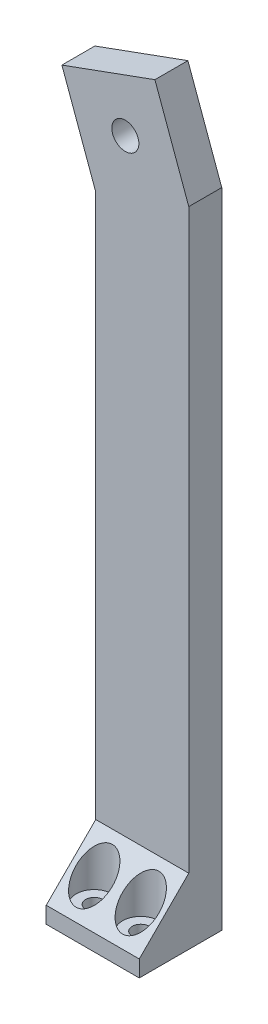
ISO-10303-21;
HEADER;
FILE_DESCRIPTION(('STEP AP214'),'2;1');
FILE_NAME('part.step','',(''),(''),'','','');
FILE_SCHEMA(('AUTOMOTIVE_DESIGN { 1 0 10303 214 1 1 1 1 }'));
ENDSEC;
DATA;
#1=APPLICATION_CONTEXT('core data for automotive mechanical design processes');
#2=APPLICATION_PROTOCOL_DEFINITION('international standard','automotive_design',2000,#1);
#3=PRODUCT_CONTEXT('',#1,'mechanical');
#4=PRODUCT('Part','Part','',(#3));
#5=PRODUCT_RELATED_PRODUCT_CATEGORY('part','',(#4));
#6=PRODUCT_DEFINITION_FORMATION('','',#4);
#7=PRODUCT_DEFINITION_CONTEXT('part definition',#1,'design');
#8=PRODUCT_DEFINITION('design','',#6,#7);
#9=PRODUCT_DEFINITION_SHAPE('','',#8);
#10=(LENGTH_UNIT() NAMED_UNIT(*) SI_UNIT(.MILLI.,.METRE.));
#11=(NAMED_UNIT(*) PLANE_ANGLE_UNIT() SI_UNIT($,.RADIAN.));
#12=(NAMED_UNIT(*) SI_UNIT($,.STERADIAN.) SOLID_ANGLE_UNIT());
#13=UNCERTAINTY_MEASURE_WITH_UNIT(LENGTH_MEASURE(1.E-05),#10,'distance_accuracy_value','');
#14=(GEOMETRIC_REPRESENTATION_CONTEXT(3) GLOBAL_UNCERTAINTY_ASSIGNED_CONTEXT((#13)) GLOBAL_UNIT_ASSIGNED_CONTEXT((#10,
#11,#12)) REPRESENTATION_CONTEXT('',''));
#15=CARTESIAN_POINT('',(0.,0.,0.));
#16=DIRECTION('',(0.,0.,1.));
#17=DIRECTION('',(1.,0.,0.));
#18=AXIS2_PLACEMENT_3D('',#15,#16,#17);
#19=CARTESIAN_POINT('',(514.481709880284,-15.,17.5));
#20=DIRECTION('',(0.,1.,0.));
#21=DIRECTION('',(0.,0.,1.));
#22=AXIS2_PLACEMENT_3D('',#19,#20,#21);
#23=CYLINDRICAL_SURFACE('',#22,2.60000000000007);
#24=CARTESIAN_POINT('',(514.481709880284,0.,17.5));
#25=DIRECTION('',(0.,1.,0.));
#26=DIRECTION('',(0.,0.,1.));
#27=AXIS2_PLACEMENT_3D('',#24,#25,#26);
#28=CIRCLE('',#27,2.60000000000007);
#29=CARTESIAN_POINT('',(514.481709880284,0.,20.1000000000001));
#30=VERTEX_POINT('',#29);
#31=EDGE_CURVE('E130',#30,#30,#28,.T.);
#32=ORIENTED_EDGE('',*,*,#31,.F.);
#33=EDGE_LOOP('',(#32));
#34=FACE_BOUND('',#33,.T.);
#35=CARTESIAN_POINT('',(514.481709880284,5.,17.5));
#36=DIRECTION('',(0.,1.,0.));
#37=DIRECTION('',(0.,0.,1.));
#38=AXIS2_PLACEMENT_3D('',#35,#36,#37);
#39=CIRCLE('',#38,2.60000000000007);
#40=CARTESIAN_POINT('',(514.481709880284,5.,20.1000000000001));
#41=VERTEX_POINT('',#40);
#42=EDGE_CURVE('E41',#41,#41,#39,.F.);
#43=ORIENTED_EDGE('',*,*,#42,.F.);
#44=EDGE_LOOP('',(#43));
#45=FACE_BOUND('',#44,.T.);
#46=ADVANCED_FACE('F36',(#34,#45),#23,.F.);
#47=CARTESIAN_POINT('',(528.577099192073,-15.,17.5));
#48=DIRECTION('',(0.,1.,0.));
#49=DIRECTION('',(0.,0.,1.));
#50=AXIS2_PLACEMENT_3D('',#47,#48,#49);
#51=CYLINDRICAL_SURFACE('',#50,2.60000000000007);
#52=CARTESIAN_POINT('',(528.577099192073,0.,17.5));
#53=DIRECTION('',(0.,1.,0.));
#54=DIRECTION('',(0.,0.,1.));
#55=AXIS2_PLACEMENT_3D('',#52,#53,#54);
#56=CIRCLE('',#55,2.60000000000007);
#57=CARTESIAN_POINT('',(528.577099192073,0.,20.1000000000001));
#58=VERTEX_POINT('',#57);
#59=EDGE_CURVE('E127',#58,#58,#56,.T.);
#60=ORIENTED_EDGE('',*,*,#59,.F.);
#61=EDGE_LOOP('',(#60));
#62=FACE_BOUND('',#61,.T.);
#63=CARTESIAN_POINT('',(528.577099192073,5.,17.5));
#64=DIRECTION('',(0.,1.,0.));
#65=DIRECTION('',(0.,0.,1.));
#66=AXIS2_PLACEMENT_3D('',#63,#64,#65);
#67=CIRCLE('',#66,2.60000000000007);
#68=CARTESIAN_POINT('',(528.577099192073,5.,20.1000000000001));
#69=VERTEX_POINT('',#68);
#70=EDGE_CURVE('E184',#69,#69,#67,.F.);
#71=ORIENTED_EDGE('',*,*,#70,.F.);
#72=EDGE_LOOP('',(#71));
#73=FACE_BOUND('',#72,.T.);
#74=ADVANCED_FACE('F252',(#62,#73),#51,.F.);
#75=CARTESIAN_POINT('',(0.,0.,10.));
#76=DIRECTION('',(0.,0.,-1.));
#77=DIRECTION('',(-1.,0.,0.));
#78=AXIS2_PLACEMENT_3D('',#75,#76,#77);
#79=PLANE('',#78);
#80=CARTESIAN_POINT('',(516.399102386291,203.91656885754,10.));
#81=DIRECTION('',(0.,0.,1.));
#82=DIRECTION('',(1.,0.,0.));
#83=AXIS2_PLACEMENT_3D('',#80,#81,#82);
#84=CIRCLE('',#83,4.10000000000036);
#85=CARTESIAN_POINT('',(520.499102386291,203.91656885754,10.));
#86=VERTEX_POINT('',#85);
#87=EDGE_CURVE('E137',#86,#86,#84,.T.);
#88=ORIENTED_EDGE('',*,*,#87,.F.);
#89=EDGE_LOOP('',(#88));
#90=FACE_BOUND('',#89,.T.);
#91=DIRECTION('',(0.,-1.,0.));
#92=VECTOR('',#91,1.);
#93=CARTESIAN_POINT('',(507.434015224388,184.690877395868,10.));
#94=LINE('',#93,#92);
#95=CARTESIAN_POINT('',(507.434015224388,184.690877395868,10.));
#96=VERTEX_POINT('',#95);
#97=CARTESIAN_POINT('',(507.43401522439,19.9999999999999,10.));
#98=VERTEX_POINT('',#97);
#99=EDGE_CURVE('E151',#96,#98,#94,.T.);
#100=ORIENTED_EDGE('',*,*,#99,.T.);
#101=DIRECTION('',(1.,0.,0.));
#102=VECTOR('',#101,1.);
#103=CARTESIAN_POINT('',(535.624793847968,19.9999999999999,10.));
#104=LINE('',#103,#102);
#105=CARTESIAN_POINT('',(535.624793847967,19.9999999999999,10.));
#106=VERTEX_POINT('',#105);
#107=EDGE_CURVE('E60',#98,#106,#104,.T.);
#108=ORIENTED_EDGE('',*,*,#107,.T.);
#109=DIRECTION('',(0.,1.,0.));
#110=VECTOR('',#109,1.);
#111=CARTESIAN_POINT('',(535.624793847965,194.951481695638,10.));
#112=LINE('',#111,#110);
#113=CARTESIAN_POINT('',(535.624793847965,194.951481695638,10.));
#114=VERTEX_POINT('',#113);
#115=EDGE_CURVE('E153',#106,#114,#112,.T.);
#116=ORIENTED_EDGE('',*,*,#115,.T.);
#117=DIRECTION('',(-0.34202014332568,0.939692620785904,0.));
#118=VECTOR('',#117,1.);
#119=CARTESIAN_POINT('',(535.624793847965,194.951481695638,10.));
#120=LINE('',#119,#118);
#121=CARTESIAN_POINT('',(525.364189548195,223.142260319215,10.));
#122=VERTEX_POINT('',#121);
#123=EDGE_CURVE('E143',#114,#122,#120,.T.);
#124=ORIENTED_EDGE('',*,*,#123,.T.);
#125=DIRECTION('',(-0.939692620785904,-0.342020143325681,0.));
#126=VECTOR('',#125,1.);
#127=CARTESIAN_POINT('',(497.173410924618,212.881656019444,10.));
#128=LINE('',#127,#126);
#129=CARTESIAN_POINT('',(497.173410924618,212.881656019444,10.));
#130=VERTEX_POINT('',#129);
#131=EDGE_CURVE('E146',#122,#130,#128,.T.);
#132=ORIENTED_EDGE('',*,*,#131,.T.);
#133=DIRECTION('',(0.34202014332568,-0.939692620785904,0.));
#134=VECTOR('',#133,1.);
#135=CARTESIAN_POINT('',(507.434015224388,184.690877395868,10.));
#136=LINE('',#135,#134);
#137=EDGE_CURVE('E149',#130,#96,#136,.T.);
#138=ORIENTED_EDGE('',*,*,#137,.T.);
#139=EDGE_LOOP('',(#100,#108,#116,#124,#132,#138));
#140=FACE_BOUND('',#139,.T.);
#141=ADVANCED_FACE('F219',(#90,#140),#79,.F.);
#142=CARTESIAN_POINT('',(0.,0.,0.));
#143=DIRECTION('',(0.,0.,-1.));
#144=DIRECTION('',(-1.,0.,0.));
#145=AXIS2_PLACEMENT_3D('',#142,#143,#144);
#146=PLANE('',#145);
#147=DIRECTION('',(-0.34202014332568,0.939692620785904,0.));
#148=VECTOR('',#147,1.);
#149=CARTESIAN_POINT('',(535.624793847965,194.951481695638,0.));
#150=LINE('',#149,#148);
#151=CARTESIAN_POINT('',(535.624793847965,194.951481695638,0.));
#152=VERTEX_POINT('',#151);
#153=CARTESIAN_POINT('',(525.364189548195,223.142260319215,0.));
#154=VERTEX_POINT('',#153);
#155=EDGE_CURVE('E140',#152,#154,#150,.T.);
#156=ORIENTED_EDGE('',*,*,#155,.F.);
#157=DIRECTION('',(0.,1.,0.));
#158=VECTOR('',#157,1.);
#159=CARTESIAN_POINT('',(535.624793847965,194.951481695638,0.));
#160=LINE('',#159,#158);
#161=CARTESIAN_POINT('',(535.624793847968,0.,0.));
#162=VERTEX_POINT('',#161);
#163=EDGE_CURVE('E147',#162,#152,#160,.T.);
#164=ORIENTED_EDGE('',*,*,#163,.F.);
#165=DIRECTION('',(1.,0.,0.));
#166=VECTOR('',#165,1.);
#167=CARTESIAN_POINT('',(507.43401522439,0.,0.));
#168=LINE('',#167,#166);
#169=CARTESIAN_POINT('',(507.43401522439,0.,0.));
#170=VERTEX_POINT('',#169);
#171=EDGE_CURVE('E163',#170,#162,#168,.T.);
#172=ORIENTED_EDGE('',*,*,#171,.F.);
#173=DIRECTION('',(0.,-1.,0.));
#174=VECTOR('',#173,1.);
#175=CARTESIAN_POINT('',(507.434015224388,184.690877395868,0.));
#176=LINE('',#175,#174);
#177=CARTESIAN_POINT('',(507.434015224388,184.690877395868,0.));
#178=VERTEX_POINT('',#177);
#179=EDGE_CURVE('E108',#178,#170,#176,.T.);
#180=ORIENTED_EDGE('',*,*,#179,.F.);
#181=DIRECTION('',(0.34202014332568,-0.939692620785904,0.));
#182=VECTOR('',#181,1.);
#183=CARTESIAN_POINT('',(507.434015224388,184.690877395868,0.));
#184=LINE('',#183,#182);
#185=CARTESIAN_POINT('',(497.173410924618,212.881656019444,0.));
#186=VERTEX_POINT('',#185);
#187=EDGE_CURVE('E160',#186,#178,#184,.T.);
#188=ORIENTED_EDGE('',*,*,#187,.F.);
#189=DIRECTION('',(-0.939692620785904,-0.342020143325681,0.));
#190=VECTOR('',#189,1.);
#191=CARTESIAN_POINT('',(497.173410924618,212.881656019444,0.));
#192=LINE('',#191,#190);
#193=EDGE_CURVE('E158',#154,#186,#192,.T.);
#194=ORIENTED_EDGE('',*,*,#193,.F.);
#195=EDGE_LOOP('',(#156,#164,#172,#180,#188,#194));
#196=FACE_BOUND('',#195,.T.);
#197=CARTESIAN_POINT('',(516.399102386291,203.91656885754,0.));
#198=DIRECTION('',(0.,0.,1.));
#199=DIRECTION('',(1.,0.,0.));
#200=AXIS2_PLACEMENT_3D('',#197,#198,#199);
#201=CIRCLE('',#200,4.10000000000036);
#202=CARTESIAN_POINT('',(520.499102386291,203.91656885754,0.));
#203=VERTEX_POINT('',#202);
#204=EDGE_CURVE('E136',#203,#203,#201,.T.);
#205=ORIENTED_EDGE('',*,*,#204,.T.);
#206=EDGE_LOOP('',(#205));
#207=FACE_BOUND('',#206,.T.);
#208=ADVANCED_FACE('F233',(#196,#207),#146,.T.);
#209=CARTESIAN_POINT('',(535.624793847965,194.951481695638,10.));
#210=DIRECTION('',(-0.939692620785904,-0.34202014332568,0.));
#211=DIRECTION('',(0.34202014332568,-0.939692620785904,0.));
#212=AXIS2_PLACEMENT_3D('',#209,#210,#211);
#213=PLANE('',#212);
#214=ORIENTED_EDGE('',*,*,#155,.T.);
#215=DIRECTION('',(0.,0.,-1.));
#216=VECTOR('',#215,1.);
#217=CARTESIAN_POINT('',(525.364189548195,223.142260319215,10.));
#218=LINE('',#217,#216);
#219=EDGE_CURVE('E173',#122,#154,#218,.T.);
#220=ORIENTED_EDGE('',*,*,#219,.F.);
#221=ORIENTED_EDGE('',*,*,#123,.F.);
#222=DIRECTION('',(0.,0.,-1.));
#223=VECTOR('',#222,1.);
#224=CARTESIAN_POINT('',(535.624793847965,194.951481695638,10.));
#225=LINE('',#224,#223);
#226=EDGE_CURVE('E155',#114,#152,#225,.T.);
#227=ORIENTED_EDGE('',*,*,#226,.T.);
#228=EDGE_LOOP('',(#214,#220,#221,#227));
#229=FACE_BOUND('',#228,.T.);
#230=ADVANCED_FACE('F223',(#229),#213,.F.);
#231=CARTESIAN_POINT('',(497.173410924618,212.881656019444,10.));
#232=DIRECTION('',(0.342020143325681,-0.939692620785904,0.));
#233=DIRECTION('',(0.939692620785904,0.342020143325681,0.));
#234=AXIS2_PLACEMENT_3D('',#231,#232,#233);
#235=PLANE('',#234);
#236=ORIENTED_EDGE('',*,*,#193,.T.);
#237=DIRECTION('',(0.,0.,-1.));
#238=VECTOR('',#237,1.);
#239=CARTESIAN_POINT('',(497.173410924618,212.881656019444,10.));
#240=LINE('',#239,#238);
#241=EDGE_CURVE('E170',#130,#186,#240,.T.);
#242=ORIENTED_EDGE('',*,*,#241,.F.);
#243=ORIENTED_EDGE('',*,*,#131,.F.);
#244=ORIENTED_EDGE('',*,*,#219,.T.);
#245=EDGE_LOOP('',(#236,#242,#243,#244));
#246=FACE_BOUND('',#245,.T.);
#247=ADVANCED_FACE('F226',(#246),#235,.F.);
#248=CARTESIAN_POINT('',(507.434015224388,184.690877395868,10.));
#249=DIRECTION('',(0.939692620785904,0.34202014332568,0.));
#250=DIRECTION('',(-0.34202014332568,0.939692620785904,0.));
#251=AXIS2_PLACEMENT_3D('',#248,#249,#250);
#252=PLANE('',#251);
#253=ORIENTED_EDGE('',*,*,#187,.T.);
#254=DIRECTION('',(0.,0.,-1.));
#255=VECTOR('',#254,1.);
#256=CARTESIAN_POINT('',(507.434015224388,184.690877395868,10.));
#257=LINE('',#256,#255);
#258=EDGE_CURVE('E111',#96,#178,#257,.T.);
#259=ORIENTED_EDGE('',*,*,#258,.F.);
#260=ORIENTED_EDGE('',*,*,#137,.F.);
#261=ORIENTED_EDGE('',*,*,#241,.T.);
#262=EDGE_LOOP('',(#253,#259,#260,#261));
#263=FACE_BOUND('',#262,.T.);
#264=ADVANCED_FACE('F231',(#263),#252,.F.);
#265=CARTESIAN_POINT('',(507.434015224388,184.690877395868,10.));
#266=DIRECTION('',(1.,0.,0.));
#267=DIRECTION('',(0.,1.,0.));
#268=AXIS2_PLACEMENT_3D('',#265,#266,#267);
#269=PLANE('',#268);
#270=ORIENTED_EDGE('',*,*,#179,.T.);
#271=DIRECTION('',(0.,0.,-1.));
#272=VECTOR('',#271,1.);
#273=CARTESIAN_POINT('',(507.43401522439,0.,10.));
#274=LINE('',#273,#272);
#275=CARTESIAN_POINT('',(507.43401522439,0.,25.));
#276=VERTEX_POINT('',#275);
#277=EDGE_CURVE('E101',#276,#170,#274,.T.);
#278=ORIENTED_EDGE('',*,*,#277,.F.);
#279=DIRECTION('',(0.,-1.,0.));
#280=VECTOR('',#279,1.);
#281=CARTESIAN_POINT('',(507.43401522439,0.,25.));
#282=LINE('',#281,#280);
#283=CARTESIAN_POINT('',(507.43401522439,5.,25.));
#284=VERTEX_POINT('',#283);
#285=EDGE_CURVE('E105',#284,#276,#282,.T.);
#286=ORIENTED_EDGE('',*,*,#285,.F.);
#287=DIRECTION('',(0.,-0.707106781186546,0.707106781186549));
#288=VECTOR('',#287,1.);
#289=CARTESIAN_POINT('',(507.434015224389,102.345438697933,-72.3454386979338));
#290=LINE('',#289,#288);
#291=EDGE_CURVE('E46',#284,#98,#290,.F.);
#292=ORIENTED_EDGE('',*,*,#291,.T.);
#293=ORIENTED_EDGE('',*,*,#99,.F.);
#294=ORIENTED_EDGE('',*,*,#258,.T.);
#295=EDGE_LOOP('',(#270,#278,#286,#292,#293,#294));
#296=FACE_BOUND('',#295,.T.);
#297=ADVANCED_FACE('F103',(#296),#269,.F.);
#298=CARTESIAN_POINT('',(507.43401522439,0.,10.));
#299=DIRECTION('',(0.,1.,0.));
#300=DIRECTION('',(0.,0.,1.));
#301=AXIS2_PLACEMENT_3D('',#298,#299,#300);
#302=PLANE('',#301);
#303=ORIENTED_EDGE('',*,*,#59,.T.);
#304=EDGE_LOOP('',(#303));
#305=FACE_BOUND('',#304,.T.);
#306=ORIENTED_EDGE('',*,*,#31,.T.);
#307=EDGE_LOOP('',(#306));
#308=FACE_BOUND('',#307,.T.);
#309=ORIENTED_EDGE('',*,*,#171,.T.);
#310=DIRECTION('',(0.,0.,-1.));
#311=VECTOR('',#310,1.);
#312=CARTESIAN_POINT('',(535.624793847968,0.,10.));
#313=LINE('',#312,#311);
#314=CARTESIAN_POINT('',(535.624793847967,0.,25.));
#315=VERTEX_POINT('',#314);
#316=EDGE_CURVE('E112',#315,#162,#313,.T.);
#317=ORIENTED_EDGE('',*,*,#316,.F.);
#318=DIRECTION('',(1.,0.,0.));
#319=VECTOR('',#318,1.);
#320=CARTESIAN_POINT('',(507.43401522439,0.,25.));
#321=LINE('',#320,#319);
#322=EDGE_CURVE('E115',#276,#315,#321,.T.);
#323=ORIENTED_EDGE('',*,*,#322,.F.);
#324=ORIENTED_EDGE('',*,*,#277,.T.);
#325=EDGE_LOOP('',(#309,#317,#323,#324));
#326=FACE_BOUND('',#325,.T.);
#327=ADVANCED_FACE('F116',(#305,#308,#326),#302,.F.);
#328=CARTESIAN_POINT('',(535.624793847965,194.951481695638,10.));
#329=DIRECTION('',(-1.,0.,0.));
#330=DIRECTION('',(0.,-1.,0.));
#331=AXIS2_PLACEMENT_3D('',#328,#329,#330);
#332=PLANE('',#331);
#333=ORIENTED_EDGE('',*,*,#163,.T.);
#334=ORIENTED_EDGE('',*,*,#226,.F.);
#335=ORIENTED_EDGE('',*,*,#115,.F.);
#336=DIRECTION('',(0.,0.707106781186546,-0.707106781186549));
#337=VECTOR('',#336,1.);
#338=CARTESIAN_POINT('',(535.624793847966,107.475740847819,-77.475740847819));
#339=LINE('',#338,#337);
#340=CARTESIAN_POINT('',(535.624793847968,5.,25.));
#341=VERTEX_POINT('',#340);
#342=EDGE_CURVE('E11',#106,#341,#339,.F.);
#343=ORIENTED_EDGE('',*,*,#342,.T.);
#344=DIRECTION('',(0.,1.,0.));
#345=VECTOR('',#344,1.);
#346=CARTESIAN_POINT('',(535.624793847967,0.,25.));
#347=LINE('',#346,#345);
#348=EDGE_CURVE('E121',#315,#341,#347,.T.);
#349=ORIENTED_EDGE('',*,*,#348,.F.);
#350=ORIENTED_EDGE('',*,*,#316,.T.);
#351=EDGE_LOOP('',(#333,#334,#335,#343,#349,#350));
#352=FACE_BOUND('',#351,.T.);
#353=ADVANCED_FACE('F216',(#352),#332,.F.);
#354=CARTESIAN_POINT('',(516.399102386291,203.91656885754,10.));
#355=DIRECTION('',(0.,0.,-1.));
#356=DIRECTION('',(-1.,0.,0.));
#357=AXIS2_PLACEMENT_3D('',#354,#355,#356);
#358=CYLINDRICAL_SURFACE('',#357,4.10000000000036);
#359=ORIENTED_EDGE('',*,*,#87,.T.);
#360=EDGE_LOOP('',(#359));
#361=FACE_BOUND('',#360,.T.);
#362=ORIENTED_EDGE('',*,*,#204,.F.);
#363=EDGE_LOOP('',(#362));
#364=FACE_BOUND('',#363,.T.);
#365=ADVANCED_FACE('F240',(#361,#364),#358,.F.);
#366=CARTESIAN_POINT('',(0.,0.,25.));
#367=DIRECTION('',(0.,0.,-1.));
#368=DIRECTION('',(-1.,0.,0.));
#369=AXIS2_PLACEMENT_3D('',#366,#367,#368);
#370=PLANE('',#369);
#371=ORIENTED_EDGE('',*,*,#285,.T.);
#372=ORIENTED_EDGE('',*,*,#322,.T.);
#373=ORIENTED_EDGE('',*,*,#348,.T.);
#374=DIRECTION('',(-1.,0.,0.));
#375=VECTOR('',#374,1.);
#376=CARTESIAN_POINT('',(507.43401522439,5.,25.));
#377=LINE('',#376,#375);
#378=EDGE_CURVE('E126',#341,#284,#377,.T.);
#379=ORIENTED_EDGE('',*,*,#378,.T.);
#380=EDGE_LOOP('',(#371,#372,#373,#379));
#381=FACE_BOUND('',#380,.T.);
#382=ADVANCED_FACE('F124',(#381),#370,.F.);
#383=CARTESIAN_POINT('',(507.43401522439,5.,25.));
#384=DIRECTION('',(0.,0.707106781186549,0.707106781186546));
#385=DIRECTION('',(1.,0.,0.));
#386=AXIS2_PLACEMENT_3D('',#383,#384,#385);
#387=PLANE('',#386);
#388=CARTESIAN_POINT('',(514.481709880284,12.5,17.5));
#389=DIRECTION('',(0.,0.707106781186549,0.707106781186546));
#390=DIRECTION('',(0.,-0.707106781186546,0.707106781186549));
#391=AXIS2_PLACEMENT_3D('',#388,#389,#390);
#392=ELLIPSE('',#391,7.77817459305195,5.49999999999996);
#393=CARTESIAN_POINT('',(514.481709880284,7.00000000000003,23.));
#394=VERTEX_POINT('',#393);
#395=EDGE_CURVE('E181',#394,#394,#392,.T.);
#396=ORIENTED_EDGE('',*,*,#395,.F.);
#397=EDGE_LOOP('',(#396));
#398=FACE_BOUND('',#397,.T.);
#399=CARTESIAN_POINT('',(528.577099192073,12.5,17.5));
#400=DIRECTION('',(0.,0.707106781186549,0.707106781186546));
#401=DIRECTION('',(0.,-0.707106781186546,0.707106781186549));
#402=AXIS2_PLACEMENT_3D('',#399,#400,#401);
#403=ELLIPSE('',#402,7.77817459305195,5.49999999999996);
#404=CARTESIAN_POINT('',(528.577099192073,7.00000000000003,23.));
#405=VERTEX_POINT('',#404);
#406=EDGE_CURVE('E178',#405,#405,#403,.T.);
#407=ORIENTED_EDGE('',*,*,#406,.F.);
#408=EDGE_LOOP('',(#407));
#409=FACE_BOUND('',#408,.T.);
#410=ORIENTED_EDGE('',*,*,#342,.F.);
#411=ORIENTED_EDGE('',*,*,#107,.F.);
#412=ORIENTED_EDGE('',*,*,#291,.F.);
#413=ORIENTED_EDGE('',*,*,#378,.F.);
#414=EDGE_LOOP('',(#410,#411,#412,#413));
#415=FACE_BOUND('',#414,.T.);
#416=ADVANCED_FACE('F39',(#398,#409,#415),#387,.T.);
#417=CARTESIAN_POINT('',(528.577099192073,5.,17.5));
#418=DIRECTION('',(0.,1.,0.));
#419=DIRECTION('',(0.,0.,1.));
#420=AXIS2_PLACEMENT_3D('',#417,#418,#419);
#421=PLANE('',#420);
#422=CARTESIAN_POINT('',(528.577099192073,5.,17.5));
#423=DIRECTION('',(0.,1.,0.));
#424=DIRECTION('',(0.,0.,1.));
#425=AXIS2_PLACEMENT_3D('',#422,#423,#424);
#426=CIRCLE('',#425,5.49999999999996);
#427=CARTESIAN_POINT('',(528.577099192073,5.,23.));
#428=VERTEX_POINT('',#427);
#429=EDGE_CURVE('E195',#428,#428,#426,.T.);
#430=ORIENTED_EDGE('',*,*,#429,.T.);
#431=EDGE_LOOP('',(#430));
#432=FACE_BOUND('',#431,.T.);
#433=ORIENTED_EDGE('',*,*,#70,.T.);
#434=EDGE_LOOP('',(#433));
#435=FACE_BOUND('',#434,.T.);
#436=ADVANCED_FACE('F211',(#432,#435),#421,.T.);
#437=CARTESIAN_POINT('',(528.577099192073,25.,17.5));
#438=DIRECTION('',(0.,-1.,0.));
#439=DIRECTION('',(0.,0.,-1.));
#440=AXIS2_PLACEMENT_3D('',#437,#438,#439);
#441=CYLINDRICAL_SURFACE('',#440,5.49999999999996);
#442=ORIENTED_EDGE('',*,*,#429,.F.);
#443=EDGE_LOOP('',(#442));
#444=FACE_BOUND('',#443,.T.);
#445=ORIENTED_EDGE('',*,*,#406,.T.);
#446=EDGE_LOOP('',(#445));
#447=FACE_BOUND('',#446,.T.);
#448=ADVANCED_FACE('F262',(#444,#447),#441,.F.);
#449=CARTESIAN_POINT('',(514.481709880284,5.,17.5));
#450=DIRECTION('',(0.,1.,0.));
#451=DIRECTION('',(0.,0.,1.));
#452=AXIS2_PLACEMENT_3D('',#449,#450,#451);
#453=PLANE('',#452);
#454=CARTESIAN_POINT('',(514.481709880284,5.,17.5));
#455=DIRECTION('',(0.,1.,0.));
#456=DIRECTION('',(0.,0.,1.));
#457=AXIS2_PLACEMENT_3D('',#454,#455,#456);
#458=CIRCLE('',#457,5.49999999999996);
#459=CARTESIAN_POINT('',(514.481709880284,5.,23.));
#460=VERTEX_POINT('',#459);
#461=EDGE_CURVE('E182',#460,#460,#458,.T.);
#462=ORIENTED_EDGE('',*,*,#461,.T.);
#463=EDGE_LOOP('',(#462));
#464=FACE_BOUND('',#463,.T.);
#465=ORIENTED_EDGE('',*,*,#42,.T.);
#466=EDGE_LOOP('',(#465));
#467=FACE_BOUND('',#466,.T.);
#468=ADVANCED_FACE('F201',(#464,#467),#453,.T.);
#469=CARTESIAN_POINT('',(514.481709880284,25.,17.5));
#470=DIRECTION('',(0.,-1.,0.));
#471=DIRECTION('',(0.,0.,-1.));
#472=AXIS2_PLACEMENT_3D('',#469,#470,#471);
#473=CYLINDRICAL_SURFACE('',#472,5.49999999999996);
#474=ORIENTED_EDGE('',*,*,#461,.F.);
#475=EDGE_LOOP('',(#474));
#476=FACE_BOUND('',#475,.T.);
#477=ORIENTED_EDGE('',*,*,#395,.T.);
#478=EDGE_LOOP('',(#477));
#479=FACE_BOUND('',#478,.T.);
#480=ADVANCED_FACE('F203',(#476,#479),#473,.F.);
#481=CLOSED_SHELL('',(#46,#74,#141,#208,#230,#247,#264,#297,#327,#353,#365,#382,#416,#436,#448,
#468,#480));
#482=MANIFOLD_SOLID_BREP('B2',#481);
#483=ADVANCED_BREP_SHAPE_REPRESENTATION('',(#18,#482),#14);
#484=SHAPE_DEFINITION_REPRESENTATION(#9,#483);
ENDSEC;
END-ISO-10303-21;
